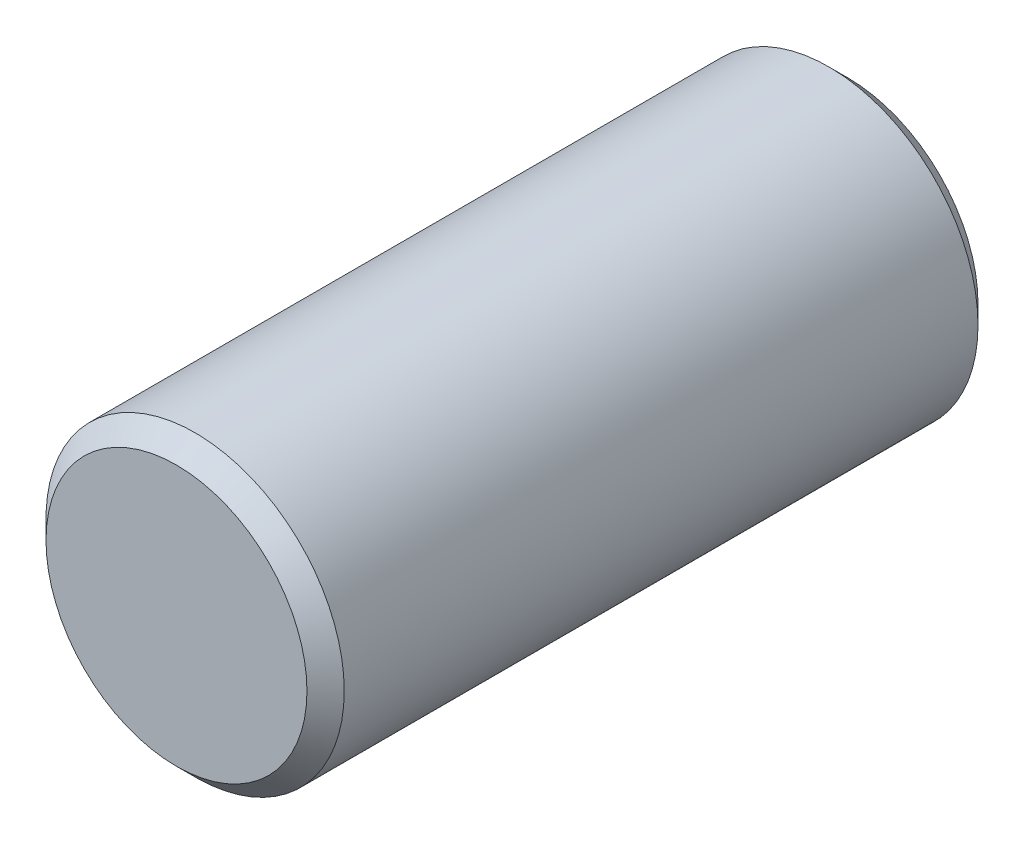
ISO-10303-21;
HEADER;
FILE_DESCRIPTION(('STEP AP214'),'2;1');
FILE_NAME('part.step','',(''),(''),'','','');
FILE_SCHEMA(('AUTOMOTIVE_DESIGN { 1 0 10303 214 1 1 1 1 }'));
ENDSEC;
DATA;
#1=APPLICATION_CONTEXT('core data for automotive mechanical design processes');
#2=APPLICATION_PROTOCOL_DEFINITION('international standard','automotive_design',2000,#1);
#3=PRODUCT_CONTEXT('',#1,'mechanical');
#4=PRODUCT('Part','Part','',(#3));
#5=PRODUCT_RELATED_PRODUCT_CATEGORY('part','',(#4));
#6=PRODUCT_DEFINITION_FORMATION('','',#4);
#7=PRODUCT_DEFINITION_CONTEXT('part definition',#1,'design');
#8=PRODUCT_DEFINITION('design','',#6,#7);
#9=PRODUCT_DEFINITION_SHAPE('','',#8);
#10=(LENGTH_UNIT() NAMED_UNIT(*) SI_UNIT(.MILLI.,.METRE.));
#11=(NAMED_UNIT(*) PLANE_ANGLE_UNIT() SI_UNIT($,.RADIAN.));
#12=(NAMED_UNIT(*) SI_UNIT($,.STERADIAN.) SOLID_ANGLE_UNIT());
#13=UNCERTAINTY_MEASURE_WITH_UNIT(LENGTH_MEASURE(1.E-05),#10,'distance_accuracy_value','');
#14=(GEOMETRIC_REPRESENTATION_CONTEXT(3) GLOBAL_UNCERTAINTY_ASSIGNED_CONTEXT((#13)) GLOBAL_UNIT_ASSIGNED_CONTEXT((#10,
#11,#12)) REPRESENTATION_CONTEXT('',''));
#15=CARTESIAN_POINT('',(0.,0.,0.));
#16=DIRECTION('',(0.,0.,1.));
#17=DIRECTION('',(1.,0.,0.));
#18=AXIS2_PLACEMENT_3D('',#15,#16,#17);
#19=CARTESIAN_POINT('',(0.,0.,-9.));
#20=DIRECTION('',(0.,0.,1.));
#21=DIRECTION('',(1.,0.,0.));
#22=AXIS2_PLACEMENT_3D('',#19,#20,#21);
#23=CYLINDRICAL_SURFACE('',#22,4.);
#24=CARTESIAN_POINT('',(0.,0.,-8.5));
#25=DIRECTION('',(0.,0.,1.));
#26=DIRECTION('',(1.,0.,0.));
#27=AXIS2_PLACEMENT_3D('',#24,#25,#26);
#28=CIRCLE('',#27,4.);
#29=CARTESIAN_POINT('',(4.,0.,-8.5));
#30=VERTEX_POINT('',#29);
#31=EDGE_CURVE('E41',#30,#30,#28,.T.);
#32=ORIENTED_EDGE('',*,*,#31,.T.);
#33=EDGE_LOOP('',(#32));
#34=FACE_BOUND('',#33,.T.);
#35=CARTESIAN_POINT('',(0.,0.,8.49999999999999));
#36=DIRECTION('',(0.,0.,1.));
#37=DIRECTION('',(1.,0.,0.));
#38=AXIS2_PLACEMENT_3D('',#35,#36,#37);
#39=CIRCLE('',#38,4.);
#40=CARTESIAN_POINT('',(4.,0.,8.49999999999999));
#41=VERTEX_POINT('',#40);
#42=EDGE_CURVE('E45',#41,#41,#39,.F.);
#43=ORIENTED_EDGE('',*,*,#42,.T.);
#44=EDGE_LOOP('',(#43));
#45=FACE_BOUND('',#44,.T.);
#46=ADVANCED_FACE('F30',(#34,#45),#23,.T.);
#47=CARTESIAN_POINT('',(0.,0.,-9.));
#48=DIRECTION('',(0.,0.,1.));
#49=DIRECTION('',(1.,0.,0.));
#50=AXIS2_PLACEMENT_3D('',#47,#48,#49);
#51=PLANE('',#50);
#52=CARTESIAN_POINT('',(0.,0.,-9.));
#53=DIRECTION('',(0.,0.,1.));
#54=DIRECTION('',(1.,0.,0.));
#55=AXIS2_PLACEMENT_3D('',#52,#53,#54);
#56=CIRCLE('',#55,3.5);
#57=CARTESIAN_POINT('',(3.5,0.,-9.));
#58=VERTEX_POINT('',#57);
#59=EDGE_CURVE('E37',#58,#58,#56,.F.);
#60=ORIENTED_EDGE('',*,*,#59,.T.);
#61=EDGE_LOOP('',(#60));
#62=FACE_BOUND('',#61,.T.);
#63=ADVANCED_FACE('F61',(#62),#51,.F.);
#64=CARTESIAN_POINT('',(0.,0.,9.));
#65=DIRECTION('',(0.,0.,1.));
#66=DIRECTION('',(1.,0.,0.));
#67=AXIS2_PLACEMENT_3D('',#64,#65,#66);
#68=PLANE('',#67);
#69=CARTESIAN_POINT('',(0.,0.,9.));
#70=DIRECTION('',(0.,0.,1.));
#71=DIRECTION('',(1.,0.,0.));
#72=AXIS2_PLACEMENT_3D('',#69,#70,#71);
#73=CIRCLE('',#72,3.5);
#74=CARTESIAN_POINT('',(3.5,0.,9.));
#75=VERTEX_POINT('',#74);
#76=EDGE_CURVE('E10',#75,#75,#73,.T.);
#77=ORIENTED_EDGE('',*,*,#76,.T.);
#78=EDGE_LOOP('',(#77));
#79=FACE_BOUND('',#78,.T.);
#80=ADVANCED_FACE('F58',(#79),#68,.T.);
#81=CARTESIAN_POINT('',(0.,0.,-8.5));
#82=DIRECTION('',(0.,0.,1.));
#83=DIRECTION('',(1.,0.,0.));
#84=AXIS2_PLACEMENT_3D('',#81,#82,#83);
#85=CONICAL_SURFACE('',#84,4.,0.785398163397452);
#86=ORIENTED_EDGE('',*,*,#59,.F.);
#87=EDGE_LOOP('',(#86));
#88=FACE_BOUND('',#87,.T.);
#89=ORIENTED_EDGE('',*,*,#31,.F.);
#90=EDGE_LOOP('',(#89));
#91=FACE_BOUND('',#90,.T.);
#92=ADVANCED_FACE('F54',(#88,#91),#85,.T.);
#93=CARTESIAN_POINT('',(0.,0.,9.));
#94=DIRECTION('',(0.,0.,-1.));
#95=DIRECTION('',(-1.,0.,0.));
#96=AXIS2_PLACEMENT_3D('',#93,#94,#95);
#97=CONICAL_SURFACE('',#96,3.5,0.785398163397448);
#98=ORIENTED_EDGE('',*,*,#42,.F.);
#99=EDGE_LOOP('',(#98));
#100=FACE_BOUND('',#99,.T.);
#101=ORIENTED_EDGE('',*,*,#76,.F.);
#102=EDGE_LOOP('',(#101));
#103=FACE_BOUND('',#102,.T.);
#104=ADVANCED_FACE('F32',(#100,#103),#97,.T.);
#105=CLOSED_SHELL('',(#46,#63,#80,#92,#104));
#106=MANIFOLD_SOLID_BREP('B2',#105);
#107=ADVANCED_BREP_SHAPE_REPRESENTATION('',(#18,#106),#14);
#108=SHAPE_DEFINITION_REPRESENTATION(#9,#107);
ENDSEC;
END-ISO-10303-21;
